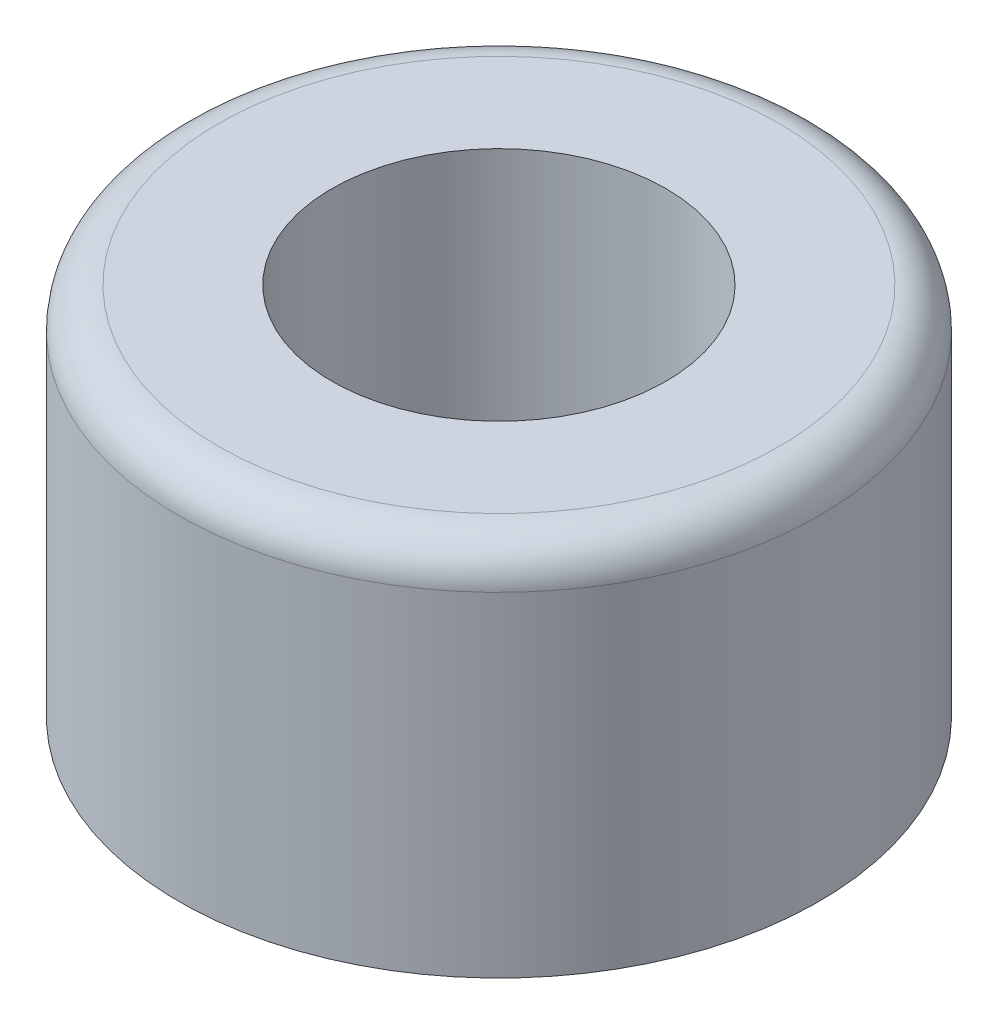
ISO-10303-21;
HEADER;
FILE_DESCRIPTION(('STEP AP214'),'2;1');
FILE_NAME('part.step','',(''),(''),'','','');
FILE_SCHEMA(('AUTOMOTIVE_DESIGN { 1 0 10303 214 1 1 1 1 }'));
ENDSEC;
DATA;
#1=APPLICATION_CONTEXT('core data for automotive mechanical design processes');
#2=APPLICATION_PROTOCOL_DEFINITION('international standard','automotive_design',2000,#1);
#3=PRODUCT_CONTEXT('',#1,'mechanical');
#4=PRODUCT('Part','Part','',(#3));
#5=PRODUCT_RELATED_PRODUCT_CATEGORY('part','',(#4));
#6=PRODUCT_DEFINITION_FORMATION('','',#4);
#7=PRODUCT_DEFINITION_CONTEXT('part definition',#1,'design');
#8=PRODUCT_DEFINITION('design','',#6,#7);
#9=PRODUCT_DEFINITION_SHAPE('','',#8);
#10=(LENGTH_UNIT() NAMED_UNIT(*) SI_UNIT(.MILLI.,.METRE.));
#11=(NAMED_UNIT(*) PLANE_ANGLE_UNIT() SI_UNIT($,.RADIAN.));
#12=(NAMED_UNIT(*) SI_UNIT($,.STERADIAN.) SOLID_ANGLE_UNIT());
#13=UNCERTAINTY_MEASURE_WITH_UNIT(LENGTH_MEASURE(1.E-05),#10,'distance_accuracy_value','');
#14=(GEOMETRIC_REPRESENTATION_CONTEXT(3) GLOBAL_UNCERTAINTY_ASSIGNED_CONTEXT((#13)) GLOBAL_UNIT_ASSIGNED_CONTEXT((#10,
#11,#12)) REPRESENTATION_CONTEXT('',''));
#15=CARTESIAN_POINT('',(0.,0.,0.));
#16=DIRECTION('',(0.,0.,1.));
#17=DIRECTION('',(1.,0.,0.));
#18=AXIS2_PLACEMENT_3D('',#15,#16,#17);
#19=CARTESIAN_POINT('',(0.,2.3749,0.));
#20=DIRECTION('',(0.,1.,0.));
#21=DIRECTION('',(0.,0.,1.));
#22=AXIS2_PLACEMENT_3D('',#19,#20,#21);
#23=PLANE('',#22);
#24=CARTESIAN_POINT('',(0.,2.3749,0.));
#25=DIRECTION('',(0.,-1.,0.));
#26=DIRECTION('',(0.,0.,-1.));
#27=AXIS2_PLACEMENT_3D('',#24,#25,#26);
#28=CIRCLE('',#27,2.1209);
#29=CARTESIAN_POINT('',(0.,2.3749,-2.1209));
#30=VERTEX_POINT('',#29);
#31=EDGE_CURVE('E40',#30,#30,#28,.T.);
#32=ORIENTED_EDGE('',*,*,#31,.T.);
#33=EDGE_LOOP('',(#32));
#34=FACE_BOUND('',#33,.T.);
#35=CARTESIAN_POINT('',(0.,2.3749,0.));
#36=DIRECTION('',(0.,-1.,0.));
#37=DIRECTION('',(0.,0.,-1.));
#38=AXIS2_PLACEMENT_3D('',#35,#36,#37);
#39=CIRCLE('',#38,3.556);
#40=CARTESIAN_POINT('',(0.,2.3749,-3.556));
#41=VERTEX_POINT('',#40);
#42=CARTESIAN_POINT('',(0.,2.3749,3.556));
#43=VERTEX_POINT('',#42);
#44=EDGE_CURVE('E34',#41,#43,#39,.T.);
#45=ORIENTED_EDGE('',*,*,#44,.F.);
#46=CARTESIAN_POINT('',(0.,2.3749,0.));
#47=DIRECTION('',(0.,-1.,0.));
#48=DIRECTION('',(0.,0.,1.));
#49=AXIS2_PLACEMENT_3D('',#46,#47,#48);
#50=CIRCLE('',#49,3.556);
#51=EDGE_CURVE('E38',#43,#41,#50,.T.);
#52=ORIENTED_EDGE('',*,*,#51,.F.);
#53=EDGE_LOOP('',(#45,#52));
#54=FACE_BOUND('',#53,.T.);
#55=ADVANCED_FACE('F16',(#34,#54),#23,.T.);
#56=CARTESIAN_POINT('',(0.,2.3749,0.));
#57=DIRECTION('',(0.,-1.,0.));
#58=DIRECTION('',(0.,0.,-1.));
#59=AXIS2_PLACEMENT_3D('',#56,#57,#58);
#60=CYLINDRICAL_SURFACE('',#59,2.1209);
#61=CARTESIAN_POINT('',(0.,-2.3749,0.));
#62=DIRECTION('',(0.,-1.,0.));
#63=DIRECTION('',(0.,0.,-1.));
#64=AXIS2_PLACEMENT_3D('',#61,#62,#63);
#65=CIRCLE('',#64,2.1209);
#66=CARTESIAN_POINT('',(0.,-2.3749,-2.1209));
#67=VERTEX_POINT('',#66);
#68=EDGE_CURVE('E45',#67,#67,#65,.T.);
#69=ORIENTED_EDGE('',*,*,#68,.T.);
#70=EDGE_LOOP('',(#69));
#71=FACE_BOUND('',#70,.T.);
#72=ORIENTED_EDGE('',*,*,#31,.F.);
#73=EDGE_LOOP('',(#72));
#74=FACE_BOUND('',#73,.T.);
#75=ADVANCED_FACE('F62',(#71,#74),#60,.F.);
#76=CARTESIAN_POINT('',(0.,1.8669,0.));
#77=DIRECTION('',(0.,1.,0.));
#78=DIRECTION('',(0.,0.,1.));
#79=AXIS2_PLACEMENT_3D('',#76,#77,#78);
#80=TOROIDAL_SURFACE('',#79,3.556,0.508);
#81=CARTESIAN_POINT('',(0.,1.8669,0.));
#82=DIRECTION('',(0.,-1.,0.));
#83=DIRECTION('',(0.,0.,-1.));
#84=AXIS2_PLACEMENT_3D('',#81,#82,#83);
#85=CIRCLE('',#84,4.064);
#86=CARTESIAN_POINT('',(0.,1.8669,-4.064));
#87=VERTEX_POINT('',#86);
#88=EDGE_CURVE('E28',#87,#87,#85,.T.);
#89=ORIENTED_EDGE('',*,*,#88,.F.);
#90=EDGE_LOOP('',(#89));
#91=FACE_BOUND('',#90,.T.);
#92=ORIENTED_EDGE('',*,*,#51,.T.);
#93=ORIENTED_EDGE('',*,*,#44,.T.);
#94=EDGE_LOOP('',(#92,#93));
#95=FACE_BOUND('',#94,.T.);
#96=ADVANCED_FACE('F44',(#91,#95),#80,.T.);
#97=CARTESIAN_POINT('',(0.,-2.3749,0.));
#98=DIRECTION('',(0.,1.,0.));
#99=DIRECTION('',(0.,0.,1.));
#100=AXIS2_PLACEMENT_3D('',#97,#98,#99);
#101=PLANE('',#100);
#102=ORIENTED_EDGE('',*,*,#68,.F.);
#103=EDGE_LOOP('',(#102));
#104=FACE_BOUND('',#103,.T.);
#105=CARTESIAN_POINT('',(0.,-2.3749,0.));
#106=DIRECTION('',(0.,-1.,0.));
#107=DIRECTION('',(0.,0.,-1.));
#108=AXIS2_PLACEMENT_3D('',#105,#106,#107);
#109=CIRCLE('',#108,4.064);
#110=CARTESIAN_POINT('',(0.,-2.3749,-4.064));
#111=VERTEX_POINT('',#110);
#112=EDGE_CURVE('E10',#111,#111,#109,.F.);
#113=ORIENTED_EDGE('',*,*,#112,.F.);
#114=EDGE_LOOP('',(#113));
#115=FACE_BOUND('',#114,.T.);
#116=ADVANCED_FACE('F61',(#104,#115),#101,.F.);
#117=CARTESIAN_POINT('',(0.,2.3749,0.));
#118=DIRECTION('',(0.,-1.,0.));
#119=DIRECTION('',(0.,0.,-1.));
#120=AXIS2_PLACEMENT_3D('',#117,#118,#119);
#121=CYLINDRICAL_SURFACE('',#120,4.064);
#122=ORIENTED_EDGE('',*,*,#88,.T.);
#123=EDGE_LOOP('',(#122));
#124=FACE_BOUND('',#123,.T.);
#125=ORIENTED_EDGE('',*,*,#112,.T.);
#126=EDGE_LOOP('',(#125));
#127=FACE_BOUND('',#126,.T.);
#128=ADVANCED_FACE('F84',(#124,#127),#121,.T.);
#129=CLOSED_SHELL('',(#55,#75,#96,#116,#128));
#130=MANIFOLD_SOLID_BREP('B1',#129);
#131=ADVANCED_BREP_SHAPE_REPRESENTATION('',(#18,#130),#14);
#132=SHAPE_DEFINITION_REPRESENTATION(#9,#131);
ENDSEC;
END-ISO-10303-21;
